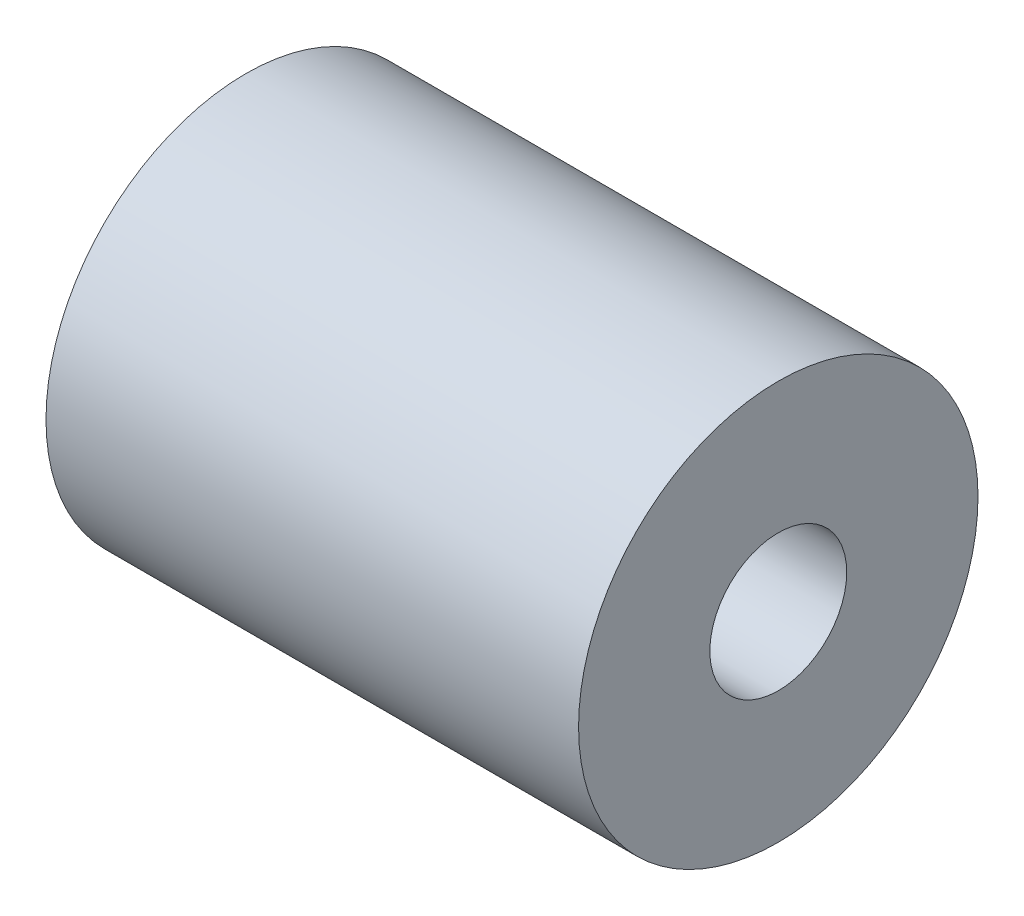
ISO-10303-21;
HEADER;
FILE_DESCRIPTION(('STEP AP214'),'2;1');
FILE_NAME('part.step','',(''),(''),'','','');
FILE_SCHEMA(('AUTOMOTIVE_DESIGN { 1 0 10303 214 1 1 1 1 }'));
ENDSEC;
DATA;
#1=APPLICATION_CONTEXT('core data for automotive mechanical design processes');
#2=APPLICATION_PROTOCOL_DEFINITION('international standard','automotive_design',2000,#1);
#3=PRODUCT_CONTEXT('',#1,'mechanical');
#4=PRODUCT('Part','Part','',(#3));
#5=PRODUCT_RELATED_PRODUCT_CATEGORY('part','',(#4));
#6=PRODUCT_DEFINITION_FORMATION('','',#4);
#7=PRODUCT_DEFINITION_CONTEXT('part definition',#1,'design');
#8=PRODUCT_DEFINITION('design','',#6,#7);
#9=PRODUCT_DEFINITION_SHAPE('','',#8);
#10=(LENGTH_UNIT() NAMED_UNIT(*) SI_UNIT(.MILLI.,.METRE.));
#11=(NAMED_UNIT(*) PLANE_ANGLE_UNIT() SI_UNIT($,.RADIAN.));
#12=(NAMED_UNIT(*) SI_UNIT($,.STERADIAN.) SOLID_ANGLE_UNIT());
#13=UNCERTAINTY_MEASURE_WITH_UNIT(LENGTH_MEASURE(1.E-05),#10,'distance_accuracy_value','');
#14=(GEOMETRIC_REPRESENTATION_CONTEXT(3) GLOBAL_UNCERTAINTY_ASSIGNED_CONTEXT((#13)) GLOBAL_UNIT_ASSIGNED_CONTEXT((#10,
#11,#12)) REPRESENTATION_CONTEXT('',''));
#15=CARTESIAN_POINT('',(0.,0.,0.));
#16=DIRECTION('',(0.,0.,1.));
#17=DIRECTION('',(1.,0.,0.));
#18=AXIS2_PLACEMENT_3D('',#15,#16,#17);
#19=CARTESIAN_POINT('',(25.4,0.,0.));
#20=DIRECTION('',(1.,0.,0.));
#21=DIRECTION('',(0.,0.,-1.));
#22=AXIS2_PLACEMENT_3D('',#19,#20,#21);
#23=PLANE('',#22);
#24=CARTESIAN_POINT('',(25.4,0.,0.));
#25=DIRECTION('',(1.,0.,0.));
#26=DIRECTION('',(0.,0.,-1.));
#27=AXIS2_PLACEMENT_3D('',#24,#25,#26);
#28=CIRCLE('',#27,9.525);
#29=CARTESIAN_POINT('',(25.4,0.,-9.525));
#30=VERTEX_POINT('',#29);
#31=EDGE_CURVE('E10',#30,#30,#28,.T.);
#32=ORIENTED_EDGE('',*,*,#31,.T.);
#33=EDGE_LOOP('',(#32));
#34=FACE_BOUND('',#33,.T.);
#35=CARTESIAN_POINT('',(25.4,0.,0.));
#36=DIRECTION('',(1.,0.,0.));
#37=DIRECTION('',(0.,0.,-1.));
#38=AXIS2_PLACEMENT_3D('',#35,#36,#37);
#39=CIRCLE('',#38,3.2639);
#40=CARTESIAN_POINT('',(25.4,0.,-3.2639));
#41=VERTEX_POINT('',#40);
#42=EDGE_CURVE('E42',#41,#41,#39,.T.);
#43=ORIENTED_EDGE('',*,*,#42,.F.);
#44=EDGE_LOOP('',(#43));
#45=FACE_BOUND('',#44,.T.);
#46=ADVANCED_FACE('F31',(#34,#45),#23,.T.);
#47=CARTESIAN_POINT('',(0.,0.,0.));
#48=DIRECTION('',(1.,0.,0.));
#49=DIRECTION('',(0.,0.,-1.));
#50=AXIS2_PLACEMENT_3D('',#47,#48,#49);
#51=PLANE('',#50);
#52=CARTESIAN_POINT('',(0.,0.,0.));
#53=DIRECTION('',(1.,0.,0.));
#54=DIRECTION('',(0.,0.,-1.));
#55=AXIS2_PLACEMENT_3D('',#52,#53,#54);
#56=CIRCLE('',#55,9.525);
#57=CARTESIAN_POINT('',(0.,0.,-9.525));
#58=VERTEX_POINT('',#57);
#59=EDGE_CURVE('E35',#58,#58,#56,.T.);
#60=ORIENTED_EDGE('',*,*,#59,.F.);
#61=EDGE_LOOP('',(#60));
#62=FACE_BOUND('',#61,.T.);
#63=CARTESIAN_POINT('',(0.,0.,0.));
#64=DIRECTION('',(1.,0.,0.));
#65=DIRECTION('',(0.,0.,-1.));
#66=AXIS2_PLACEMENT_3D('',#63,#64,#65);
#67=CIRCLE('',#66,3.2639);
#68=CARTESIAN_POINT('',(0.,0.,-3.2639));
#69=VERTEX_POINT('',#68);
#70=EDGE_CURVE('E44',#69,#69,#67,.T.);
#71=ORIENTED_EDGE('',*,*,#70,.T.);
#72=EDGE_LOOP('',(#71));
#73=FACE_BOUND('',#72,.T.);
#74=ADVANCED_FACE('F54',(#62,#73),#51,.F.);
#75=CARTESIAN_POINT('',(25.4,0.,0.));
#76=DIRECTION('',(-1.,0.,0.));
#77=DIRECTION('',(0.,0.,1.));
#78=AXIS2_PLACEMENT_3D('',#75,#76,#77);
#79=CYLINDRICAL_SURFACE('',#78,9.525);
#80=ORIENTED_EDGE('',*,*,#31,.F.);
#81=EDGE_LOOP('',(#80));
#82=FACE_BOUND('',#81,.T.);
#83=ORIENTED_EDGE('',*,*,#59,.T.);
#84=EDGE_LOOP('',(#83));
#85=FACE_BOUND('',#84,.T.);
#86=ADVANCED_FACE('F33',(#82,#85),#79,.T.);
#87=CARTESIAN_POINT('',(25.4,0.,0.));
#88=DIRECTION('',(-1.,0.,0.));
#89=DIRECTION('',(0.,0.,1.));
#90=AXIS2_PLACEMENT_3D('',#87,#88,#89);
#91=CYLINDRICAL_SURFACE('',#90,3.2639);
#92=ORIENTED_EDGE('',*,*,#42,.T.);
#93=EDGE_LOOP('',(#92));
#94=FACE_BOUND('',#93,.T.);
#95=ORIENTED_EDGE('',*,*,#70,.F.);
#96=EDGE_LOOP('',(#95));
#97=FACE_BOUND('',#96,.T.);
#98=ADVANCED_FACE('F50',(#94,#97),#91,.F.);
#99=CLOSED_SHELL('',(#46,#74,#86,#98));
#100=MANIFOLD_SOLID_BREP('B2',#99);
#101=ADVANCED_BREP_SHAPE_REPRESENTATION('',(#18,#100),#14);
#102=SHAPE_DEFINITION_REPRESENTATION(#9,#101);
ENDSEC;
END-ISO-10303-21;
